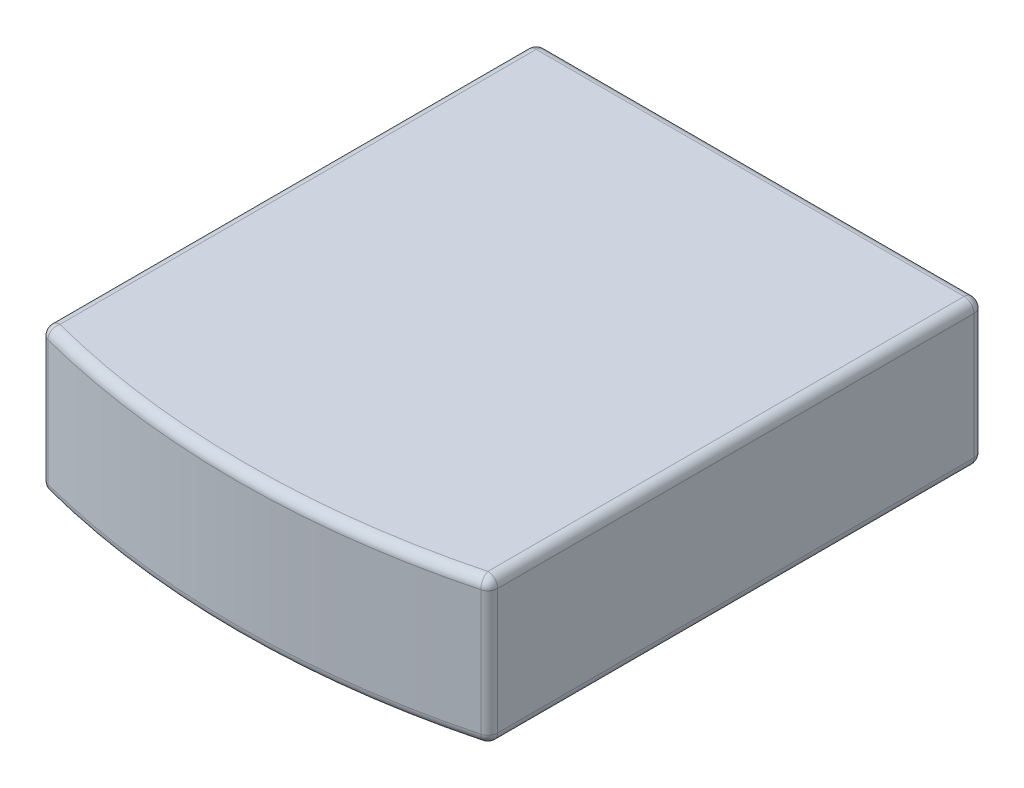
ISO-10303-21;
HEADER;
FILE_DESCRIPTION(('STEP AP214'),'2;1');
FILE_NAME('part.step','',(''),(''),'','','');
FILE_SCHEMA(('AUTOMOTIVE_DESIGN { 1 0 10303 214 1 1 1 1 }'));
ENDSEC;
DATA;
#1=APPLICATION_CONTEXT('core data for automotive mechanical design processes');
#2=APPLICATION_PROTOCOL_DEFINITION('international standard','automotive_design',2000,#1);
#3=PRODUCT_CONTEXT('',#1,'mechanical');
#4=PRODUCT('Part','Part','',(#3));
#5=PRODUCT_RELATED_PRODUCT_CATEGORY('part','',(#4));
#6=PRODUCT_DEFINITION_FORMATION('','',#4);
#7=PRODUCT_DEFINITION_CONTEXT('part definition',#1,'design');
#8=PRODUCT_DEFINITION('design','',#6,#7);
#9=PRODUCT_DEFINITION_SHAPE('','',#8);
#10=(LENGTH_UNIT() NAMED_UNIT(*) SI_UNIT(.MILLI.,.METRE.));
#11=(NAMED_UNIT(*) PLANE_ANGLE_UNIT() SI_UNIT($,.RADIAN.));
#12=(NAMED_UNIT(*) SI_UNIT($,.STERADIAN.) SOLID_ANGLE_UNIT());
#13=UNCERTAINTY_MEASURE_WITH_UNIT(LENGTH_MEASURE(1.E-05),#10,'distance_accuracy_value','');
#14=(GEOMETRIC_REPRESENTATION_CONTEXT(3) GLOBAL_UNCERTAINTY_ASSIGNED_CONTEXT((#13)) GLOBAL_UNIT_ASSIGNED_CONTEXT((#10,
#11,#12)) REPRESENTATION_CONTEXT('',''));
#15=CARTESIAN_POINT('',(0.,0.,0.));
#16=DIRECTION('',(0.,0.,1.));
#17=DIRECTION('',(1.,0.,0.));
#18=AXIS2_PLACEMENT_3D('',#15,#16,#17);
#19=CARTESIAN_POINT('',(-3.4,1.1,8.));
#20=DIRECTION('',(1.,0.,0.));
#21=DIRECTION('',(0.,1.,0.));
#22=AXIS2_PLACEMENT_3D('',#19,#20,#21);
#23=PLANE('',#22);
#24=DIRECTION('',(0.,0.,-1.));
#25=VECTOR('',#24,1.);
#26=CARTESIAN_POINT('',(-3.4,0.95,8.));
#27=LINE('',#26,#25);
#28=CARTESIAN_POINT('',(-3.4,0.95,7.38470650124955));
#29=VERTEX_POINT('',#28);
#30=CARTESIAN_POINT('',(-3.4,0.95,0.150000000000001));
#31=VERTEX_POINT('',#30);
#32=EDGE_CURVE('E164',#29,#31,#27,.T.);
#33=ORIENTED_EDGE('',*,*,#32,.T.);
#34=DIRECTION('',(0.,-1.,0.));
#35=VECTOR('',#34,1.);
#36=CARTESIAN_POINT('',(-3.4,1.1,0.150000000000001));
#37=LINE('',#36,#35);
#38=CARTESIAN_POINT('',(-3.4,-0.95,0.150000000000001));
#39=VERTEX_POINT('',#38);
#40=EDGE_CURVE('E169',#31,#39,#37,.T.);
#41=ORIENTED_EDGE('',*,*,#40,.T.);
#42=DIRECTION('',(0.,0.,-1.));
#43=VECTOR('',#42,1.);
#44=CARTESIAN_POINT('',(-3.4,-0.95,8.));
#45=LINE('',#44,#43);
#46=CARTESIAN_POINT('',(-3.4,-0.95,7.38470650124955));
#47=VERTEX_POINT('',#46);
#48=EDGE_CURVE('E166',#39,#47,#45,.F.);
#49=ORIENTED_EDGE('',*,*,#48,.T.);
#50=DIRECTION('',(0.,1.,0.));
#51=VECTOR('',#50,1.);
#52=CARTESIAN_POINT('',(-3.4,1.1,7.38470650124955));
#53=LINE('',#52,#51);
#54=EDGE_CURVE('E162',#47,#29,#53,.T.);
#55=ORIENTED_EDGE('',*,*,#54,.T.);
#56=EDGE_LOOP('',(#33,#41,#49,#55));
#57=FACE_BOUND('',#56,.T.);
#58=ADVANCED_FACE('F32',(#57),#23,.F.);
#59=CARTESIAN_POINT('',(-3.4,-1.1,8.));
#60=DIRECTION('',(0.,1.,0.));
#61=DIRECTION('',(-1.,0.,0.));
#62=AXIS2_PLACEMENT_3D('',#59,#60,#61);
#63=PLANE('',#62);
#64=DIRECTION('',(0.,0.,-1.));
#65=VECTOR('',#64,1.);
#66=CARTESIAN_POINT('',(-3.25,-1.1,8.));
#67=LINE('',#66,#65);
#68=CARTESIAN_POINT('',(-3.25,-1.1,7.38470650124954));
#69=VERTEX_POINT('',#68);
#70=CARTESIAN_POINT('',(-3.25,-1.1,0.150000000000001));
#71=VERTEX_POINT('',#70);
#72=EDGE_CURVE('E134',#69,#71,#67,.T.);
#73=ORIENTED_EDGE('',*,*,#72,.T.);
#74=DIRECTION('',(1.,0.,0.));
#75=VECTOR('',#74,1.);
#76=CARTESIAN_POINT('',(-3.4,-1.1,0.150000000000001));
#77=LINE('',#76,#75);
#78=CARTESIAN_POINT('',(3.25,-1.1,0.150000000000001));
#79=VERTEX_POINT('',#78);
#80=EDGE_CURVE('E130',#71,#79,#77,.T.);
#81=ORIENTED_EDGE('',*,*,#80,.T.);
#82=DIRECTION('',(0.,0.,-1.));
#83=VECTOR('',#82,1.);
#84=CARTESIAN_POINT('',(3.25,-1.1,8.));
#85=LINE('',#84,#83);
#86=CARTESIAN_POINT('',(3.25,-1.1,7.38470650124954));
#87=VERTEX_POINT('',#86);
#88=EDGE_CURVE('E123',#79,#87,#85,.F.);
#89=ORIENTED_EDGE('',*,*,#88,.T.);
#90=CARTESIAN_POINT('',(0.,-1.1,-5.04750971308649));
#91=DIRECTION('',(0.,1.,0.));
#92=DIRECTION('',(-1.,0.,0.));
#93=AXIS2_PLACEMENT_3D('',#90,#91,#92);
#94=CIRCLE('',#93,12.85);
#95=EDGE_CURVE('E127',#87,#69,#94,.F.);
#96=ORIENTED_EDGE('',*,*,#95,.T.);
#97=EDGE_LOOP('',(#73,#81,#89,#96));
#98=FACE_BOUND('',#97,.T.);
#99=ADVANCED_FACE('F126',(#98),#63,.F.);
#100=CARTESIAN_POINT('',(3.4,1.1,8.));
#101=DIRECTION('',(-1.,0.,0.));
#102=DIRECTION('',(0.,0.,1.));
#103=AXIS2_PLACEMENT_3D('',#100,#101,#102);
#104=PLANE('',#103);
#105=DIRECTION('',(0.,0.,-1.));
#106=VECTOR('',#105,1.);
#107=CARTESIAN_POINT('',(3.4,-0.950000000000001,8.));
#108=LINE('',#107,#106);
#109=CARTESIAN_POINT('',(3.4,-0.950000000000001,7.38470650124954));
#110=VERTEX_POINT('',#109);
#111=CARTESIAN_POINT('',(3.4,-0.950000000000001,0.150000000000001));
#112=VERTEX_POINT('',#111);
#113=EDGE_CURVE('E141',#110,#112,#108,.T.);
#114=ORIENTED_EDGE('',*,*,#113,.T.);
#115=DIRECTION('',(0.,1.,0.));
#116=VECTOR('',#115,1.);
#117=CARTESIAN_POINT('',(3.4,1.1,0.150000000000001));
#118=LINE('',#117,#116);
#119=CARTESIAN_POINT('',(3.4,0.95,0.150000000000001));
#120=VERTEX_POINT('',#119);
#121=EDGE_CURVE('E176',#112,#120,#118,.T.);
#122=ORIENTED_EDGE('',*,*,#121,.T.);
#123=DIRECTION('',(0.,0.,-1.));
#124=VECTOR('',#123,1.);
#125=CARTESIAN_POINT('',(3.4,0.95,8.));
#126=LINE('',#125,#124);
#127=CARTESIAN_POINT('',(3.4,0.95,7.38470650124954));
#128=VERTEX_POINT('',#127);
#129=EDGE_CURVE('E173',#120,#128,#126,.F.);
#130=ORIENTED_EDGE('',*,*,#129,.T.);
#131=DIRECTION('',(0.,1.,0.));
#132=VECTOR('',#131,1.);
#133=CARTESIAN_POINT('',(3.4,1.1,7.38470650124954));
#134=LINE('',#133,#132);
#135=EDGE_CURVE('E171',#128,#110,#134,.F.);
#136=ORIENTED_EDGE('',*,*,#135,.T.);
#137=EDGE_LOOP('',(#114,#122,#130,#136));
#138=FACE_BOUND('',#137,.T.);
#139=ADVANCED_FACE('F302',(#138),#104,.F.);
#140=CARTESIAN_POINT('',(-3.4,1.1,8.));
#141=DIRECTION('',(0.,-1.,0.));
#142=DIRECTION('',(1.,0.,0.));
#143=AXIS2_PLACEMENT_3D('',#140,#141,#142);
#144=PLANE('',#143);
#145=DIRECTION('',(0.,0.,-1.));
#146=VECTOR('',#145,1.);
#147=CARTESIAN_POINT('',(3.25,1.1,8.));
#148=LINE('',#147,#146);
#149=CARTESIAN_POINT('',(3.25,1.1,7.38470650124954));
#150=VERTEX_POINT('',#149);
#151=CARTESIAN_POINT('',(3.25,1.1,0.150000000000001));
#152=VERTEX_POINT('',#151);
#153=EDGE_CURVE('E182',#150,#152,#148,.T.);
#154=ORIENTED_EDGE('',*,*,#153,.T.);
#155=DIRECTION('',(-1.,0.,0.));
#156=VECTOR('',#155,1.);
#157=CARTESIAN_POINT('',(-3.4,1.1,0.150000000000001));
#158=LINE('',#157,#156);
#159=CARTESIAN_POINT('',(-3.25,1.1,0.150000000000001));
#160=VERTEX_POINT('',#159);
#161=EDGE_CURVE('E185',#152,#160,#158,.T.);
#162=ORIENTED_EDGE('',*,*,#161,.T.);
#163=DIRECTION('',(0.,0.,-1.));
#164=VECTOR('',#163,1.);
#165=CARTESIAN_POINT('',(-3.25,1.1,8.));
#166=LINE('',#165,#164);
#167=CARTESIAN_POINT('',(-3.25,1.1,7.38470650124954));
#168=VERTEX_POINT('',#167);
#169=EDGE_CURVE('E180',#160,#168,#166,.F.);
#170=ORIENTED_EDGE('',*,*,#169,.T.);
#171=CARTESIAN_POINT('',(0.,1.1,-5.04750971308649));
#172=DIRECTION('',(0.,-1.,0.));
#173=DIRECTION('',(1.,0.,0.));
#174=AXIS2_PLACEMENT_3D('',#171,#172,#173);
#175=CIRCLE('',#174,12.85);
#176=EDGE_CURVE('E178',#168,#150,#175,.F.);
#177=ORIENTED_EDGE('',*,*,#176,.T.);
#178=EDGE_LOOP('',(#154,#162,#170,#177));
#179=FACE_BOUND('',#178,.T.);
#180=ADVANCED_FACE('F289',(#179),#144,.F.);
#181=CARTESIAN_POINT('',(0.,0.,0.));
#182=DIRECTION('',(0.,0.,1.));
#183=DIRECTION('',(1.,0.,0.));
#184=AXIS2_PLACEMENT_3D('',#181,#182,#183);
#185=PLANE('',#184);
#186=DIRECTION('',(0.,-1.,0.));
#187=VECTOR('',#186,1.);
#188=CARTESIAN_POINT('',(-3.25,0.,0.));
#189=LINE('',#188,#187);
#190=CARTESIAN_POINT('',(-3.25,-0.95,0.));
#191=VERTEX_POINT('',#190);
#192=CARTESIAN_POINT('',(-3.25,0.95,0.));
#193=VERTEX_POINT('',#192);
#194=EDGE_CURVE('E187',#191,#193,#189,.F.);
#195=ORIENTED_EDGE('',*,*,#194,.T.);
#196=DIRECTION('',(-1.,0.,0.));
#197=VECTOR('',#196,1.);
#198=CARTESIAN_POINT('',(0.,0.95,0.));
#199=LINE('',#198,#197);
#200=CARTESIAN_POINT('',(3.25,0.95,0.));
#201=VERTEX_POINT('',#200);
#202=EDGE_CURVE('E193',#193,#201,#199,.F.);
#203=ORIENTED_EDGE('',*,*,#202,.T.);
#204=DIRECTION('',(0.,1.,0.));
#205=VECTOR('',#204,1.);
#206=CARTESIAN_POINT('',(3.25,0.,0.));
#207=LINE('',#206,#205);
#208=CARTESIAN_POINT('',(3.25,-0.95,0.));
#209=VERTEX_POINT('',#208);
#210=EDGE_CURVE('E191',#201,#209,#207,.F.);
#211=ORIENTED_EDGE('',*,*,#210,.T.);
#212=DIRECTION('',(1.,0.,0.));
#213=VECTOR('',#212,1.);
#214=CARTESIAN_POINT('',(0.,-0.95,0.));
#215=LINE('',#214,#213);
#216=EDGE_CURVE('E189',#209,#191,#215,.F.);
#217=ORIENTED_EDGE('',*,*,#216,.T.);
#218=EDGE_LOOP('',(#195,#203,#211,#217));
#219=FACE_BOUND('',#218,.T.);
#220=ADVANCED_FACE('F263',(#219),#185,.F.);
#221=CARTESIAN_POINT('',(0.,-6.9,-5.04750971308649));
#222=DIRECTION('',(0.,1.,0.));
#223=DIRECTION('',(-1.,0.,0.));
#224=AXIS2_PLACEMENT_3D('',#221,#222,#223);
#225=CYLINDRICAL_SURFACE('',#224,13.);
#226=DIRECTION('',(0.,1.,0.));
#227=VECTOR('',#226,1.);
#228=CARTESIAN_POINT('',(-3.28793774319066,-6.9,7.5298296477204));
#229=LINE('',#228,#227);
#230=CARTESIAN_POINT('',(-3.28793774319066,0.95,7.5298296477204));
#231=VERTEX_POINT('',#230);
#232=CARTESIAN_POINT('',(-3.28793774319066,-0.95,7.5298296477204));
#233=VERTEX_POINT('',#232);
#234=EDGE_CURVE('E56',#231,#233,#229,.F.);
#235=ORIENTED_EDGE('',*,*,#234,.T.);
#236=CARTESIAN_POINT('',(0.,-0.95,-5.04750971308649));
#237=DIRECTION('',(0.,1.,0.));
#238=DIRECTION('',(-1.,0.,0.));
#239=AXIS2_PLACEMENT_3D('',#236,#237,#238);
#240=CIRCLE('',#239,13.);
#241=CARTESIAN_POINT('',(3.28793774319066,-0.95,7.52982964772039));
#242=VERTEX_POINT('',#241);
#243=EDGE_CURVE('E11',#233,#242,#240,.T.);
#244=ORIENTED_EDGE('',*,*,#243,.T.);
#245=DIRECTION('',(0.,1.,0.));
#246=VECTOR('',#245,1.);
#247=CARTESIAN_POINT('',(3.28793774319066,-6.9,7.52982964772039));
#248=LINE('',#247,#246);
#249=CARTESIAN_POINT('',(3.28793774319066,0.949999999999999,7.52982964772039));
#250=VERTEX_POINT('',#249);
#251=EDGE_CURVE('E41',#242,#250,#248,.T.);
#252=ORIENTED_EDGE('',*,*,#251,.T.);
#253=CARTESIAN_POINT('',(0.,0.95,-5.04750971308649));
#254=DIRECTION('',(0.,-1.,0.));
#255=DIRECTION('',(1.,0.,0.));
#256=AXIS2_PLACEMENT_3D('',#253,#254,#255);
#257=CIRCLE('',#256,13.);
#258=EDGE_CURVE('E196',#250,#231,#257,.T.);
#259=ORIENTED_EDGE('',*,*,#258,.T.);
#260=EDGE_LOOP('',(#235,#244,#252,#259));
#261=FACE_BOUND('',#260,.T.);
#262=ADVANCED_FACE('F305',(#261),#225,.T.);
#263=CARTESIAN_POINT('',(3.25,0.95,8.));
#264=DIRECTION('',(0.,0.,-1.));
#265=DIRECTION('',(-1.,0.,0.));
#266=AXIS2_PLACEMENT_3D('',#263,#264,#265);
#267=CYLINDRICAL_SURFACE('',#266,0.15);
#268=CARTESIAN_POINT('',(3.25,0.95,7.38470650124954));
#269=DIRECTION('',(0.,0.,1.));
#270=DIRECTION('',(1.,0.,0.));
#271=AXIS2_PLACEMENT_3D('',#268,#269,#270);
#272=CIRCLE('',#271,0.15);
#273=EDGE_CURVE('E36',#128,#150,#272,.T.);
#274=ORIENTED_EDGE('',*,*,#273,.F.);
#275=ORIENTED_EDGE('',*,*,#129,.F.);
#276=CARTESIAN_POINT('',(3.25,0.95,0.150000000000001));
#277=DIRECTION('',(0.,0.,-1.));
#278=DIRECTION('',(-1.,0.,0.));
#279=AXIS2_PLACEMENT_3D('',#276,#277,#278);
#280=CIRCLE('',#279,0.15);
#281=EDGE_CURVE('E158',#152,#120,#280,.T.);
#282=ORIENTED_EDGE('',*,*,#281,.F.);
#283=ORIENTED_EDGE('',*,*,#153,.F.);
#284=EDGE_LOOP('',(#274,#275,#282,#283));
#285=FACE_BOUND('',#284,.T.);
#286=ADVANCED_FACE('F34',(#285),#267,.T.);
#287=CARTESIAN_POINT('',(3.25,0.95,7.38470650124955));
#288=DIRECTION('',(0.,0.,1.));
#289=DIRECTION('',(1.,0.,0.));
#290=AXIS2_PLACEMENT_3D('',#287,#288,#289);
#291=SPHERICAL_SURFACE('',#290,0.15);
#292=CARTESIAN_POINT('',(3.25,0.949999999999999,7.38470650124955));
#293=DIRECTION('',(0.,1.,0.));
#294=DIRECTION('',(-1.,0.,0.));
#295=AXIS2_PLACEMENT_3D('',#292,#293,#294);
#296=CIRCLE('',#295,0.15);
#297=EDGE_CURVE('E243',#128,#250,#296,.F.);
#298=ORIENTED_EDGE('',*,*,#297,.F.);
#299=ORIENTED_EDGE('',*,*,#273,.T.);
#300=CARTESIAN_POINT('',(3.25,0.95,7.38470650124954));
#301=DIRECTION('',(0.967487643138991,0.,-0.252918287937746));
#302=DIRECTION('',(-0.252918287937746,0.,-0.967487643138991));
#303=AXIS2_PLACEMENT_3D('',#300,#301,#302);
#304=CIRCLE('',#303,0.15);
#305=EDGE_CURVE('E246',#250,#150,#304,.F.);
#306=ORIENTED_EDGE('',*,*,#305,.F.);
#307=EDGE_LOOP('',(#298,#299,#306));
#308=FACE_BOUND('',#307,.T.);
#309=ADVANCED_FACE('F298',(#308),#291,.T.);
#310=CARTESIAN_POINT('',(3.25,0.95,0.15));
#311=DIRECTION('',(0.,0.,1.));
#312=DIRECTION('',(1.,0.,0.));
#313=AXIS2_PLACEMENT_3D('',#310,#311,#312);
#314=SPHERICAL_SURFACE('',#313,0.15);
#315=CARTESIAN_POINT('',(3.25,0.95,0.15));
#316=DIRECTION('',(1.,0.,0.));
#317=DIRECTION('',(0.,0.,-1.));
#318=AXIS2_PLACEMENT_3D('',#315,#316,#317);
#319=CIRCLE('',#318,0.15);
#320=EDGE_CURVE('E237',#152,#201,#319,.F.);
#321=ORIENTED_EDGE('',*,*,#320,.F.);
#322=ORIENTED_EDGE('',*,*,#281,.T.);
#323=CARTESIAN_POINT('',(3.25,0.95,0.150000000000001));
#324=DIRECTION('',(0.,1.,0.));
#325=DIRECTION('',(0.,0.,1.));
#326=AXIS2_PLACEMENT_3D('',#323,#324,#325);
#327=CIRCLE('',#326,0.15);
#328=EDGE_CURVE('E240',#201,#120,#327,.F.);
#329=ORIENTED_EDGE('',*,*,#328,.F.);
#330=EDGE_LOOP('',(#321,#322,#329));
#331=FACE_BOUND('',#330,.T.);
#332=ADVANCED_FACE('F253',(#331),#314,.T.);
#333=CARTESIAN_POINT('',(0.,0.95,-5.04750971308649));
#334=DIRECTION('',(0.,-1.,0.));
#335=DIRECTION('',(1.,0.,0.));
#336=AXIS2_PLACEMENT_3D('',#333,#334,#335);
#337=TOROIDAL_SURFACE('',#336,12.85,0.15);
#338=ORIENTED_EDGE('',*,*,#305,.T.);
#339=ORIENTED_EDGE('',*,*,#176,.F.);
#340=CARTESIAN_POINT('',(-3.25,0.95,7.38470650124955));
#341=DIRECTION('',(-0.967487643138992,0.,-0.252918287937742));
#342=DIRECTION('',(-0.252918287937742,0.,0.967487643138992));
#343=AXIS2_PLACEMENT_3D('',#340,#341,#342);
#344=CIRCLE('',#343,0.15);
#345=EDGE_CURVE('E231',#231,#168,#344,.T.);
#346=ORIENTED_EDGE('',*,*,#345,.F.);
#347=ORIENTED_EDGE('',*,*,#258,.F.);
#348=EDGE_LOOP('',(#338,#339,#346,#347));
#349=FACE_BOUND('',#348,.T.);
#350=ADVANCED_FACE('F292',(#349),#337,.T.);
#351=CARTESIAN_POINT('',(3.25,-6.9,7.38470650124954));
#352=DIRECTION('',(0.,1.,0.));
#353=DIRECTION('',(-1.,0.,0.));
#354=AXIS2_PLACEMENT_3D('',#351,#352,#353);
#355=CYLINDRICAL_SURFACE('',#354,0.15);
#356=ORIENTED_EDGE('',*,*,#297,.T.);
#357=ORIENTED_EDGE('',*,*,#251,.F.);
#358=CARTESIAN_POINT('',(3.25,-0.950000000000001,7.38470650124954));
#359=DIRECTION('',(0.,-1.,0.));
#360=DIRECTION('',(0.,0.,-1.));
#361=AXIS2_PLACEMENT_3D('',#358,#359,#360);
#362=CIRCLE('',#361,0.15);
#363=EDGE_CURVE('E144',#110,#242,#362,.T.);
#364=ORIENTED_EDGE('',*,*,#363,.F.);
#365=ORIENTED_EDGE('',*,*,#135,.F.);
#366=EDGE_LOOP('',(#356,#357,#364,#365));
#367=FACE_BOUND('',#366,.T.);
#368=ADVANCED_FACE('F304',(#367),#355,.T.);
#369=CARTESIAN_POINT('',(3.25,-0.950000000000001,8.));
#370=DIRECTION('',(0.,0.,-1.));
#371=DIRECTION('',(-1.,0.,0.));
#372=AXIS2_PLACEMENT_3D('',#369,#370,#371);
#373=CYLINDRICAL_SURFACE('',#372,0.15);
#374=CARTESIAN_POINT('',(3.25,-0.950000000000001,0.150000000000001));
#375=DIRECTION('',(0.,0.,-1.));
#376=DIRECTION('',(-1.,0.,0.));
#377=AXIS2_PLACEMENT_3D('',#374,#375,#376);
#378=CIRCLE('',#377,0.15);
#379=EDGE_CURVE('E145',#112,#79,#378,.T.);
#380=ORIENTED_EDGE('',*,*,#379,.F.);
#381=ORIENTED_EDGE('',*,*,#113,.F.);
#382=CARTESIAN_POINT('',(3.25,-0.95,7.38470650124954));
#383=DIRECTION('',(0.,0.,1.));
#384=DIRECTION('',(1.,0.,0.));
#385=AXIS2_PLACEMENT_3D('',#382,#383,#384);
#386=CIRCLE('',#385,0.15);
#387=EDGE_CURVE('E138',#87,#110,#386,.T.);
#388=ORIENTED_EDGE('',*,*,#387,.F.);
#389=ORIENTED_EDGE('',*,*,#88,.F.);
#390=EDGE_LOOP('',(#380,#381,#388,#389));
#391=FACE_BOUND('',#390,.T.);
#392=ADVANCED_FACE('F139',(#391),#373,.T.);
#393=CARTESIAN_POINT('',(3.25,1.1,0.150000000000001));
#394=DIRECTION('',(0.,1.,0.));
#395=DIRECTION('',(0.,0.,1.));
#396=AXIS2_PLACEMENT_3D('',#393,#394,#395);
#397=CYLINDRICAL_SURFACE('',#396,0.15);
#398=ORIENTED_EDGE('',*,*,#328,.T.);
#399=ORIENTED_EDGE('',*,*,#121,.F.);
#400=CARTESIAN_POINT('',(3.25,-0.95,0.15));
#401=DIRECTION('',(0.,-1.,0.));
#402=DIRECTION('',(1.,0.,0.));
#403=AXIS2_PLACEMENT_3D('',#400,#401,#402);
#404=CIRCLE('',#403,0.15);
#405=EDGE_CURVE('E227',#209,#112,#404,.T.);
#406=ORIENTED_EDGE('',*,*,#405,.F.);
#407=ORIENTED_EDGE('',*,*,#210,.F.);
#408=EDGE_LOOP('',(#398,#399,#406,#407));
#409=FACE_BOUND('',#408,.T.);
#410=ADVANCED_FACE('F259',(#409),#397,.T.);
#411=CARTESIAN_POINT('',(-3.4,0.95,0.150000000000001));
#412=DIRECTION('',(-1.,0.,0.));
#413=DIRECTION('',(0.,-1.,0.));
#414=AXIS2_PLACEMENT_3D('',#411,#412,#413);
#415=CYLINDRICAL_SURFACE('',#414,0.15);
#416=ORIENTED_EDGE('',*,*,#320,.T.);
#417=ORIENTED_EDGE('',*,*,#202,.F.);
#418=CARTESIAN_POINT('',(-3.25,0.95,0.150000000000001));
#419=DIRECTION('',(-1.,0.,0.));
#420=DIRECTION('',(0.,0.,1.));
#421=AXIS2_PLACEMENT_3D('',#418,#419,#420);
#422=CIRCLE('',#421,0.15);
#423=EDGE_CURVE('E224',#160,#193,#422,.T.);
#424=ORIENTED_EDGE('',*,*,#423,.F.);
#425=ORIENTED_EDGE('',*,*,#161,.F.);
#426=EDGE_LOOP('',(#416,#417,#424,#425));
#427=FACE_BOUND('',#426,.T.);
#428=ADVANCED_FACE('F269',(#427),#415,.T.);
#429=CARTESIAN_POINT('',(-3.25,0.95,8.));
#430=DIRECTION('',(0.,0.,-1.));
#431=DIRECTION('',(-1.,0.,0.));
#432=AXIS2_PLACEMENT_3D('',#429,#430,#431);
#433=CYLINDRICAL_SURFACE('',#432,0.15);
#434=CARTESIAN_POINT('',(-3.25,0.95,7.38470650124954));
#435=DIRECTION('',(0.,0.,1.));
#436=DIRECTION('',(1.,0.,0.));
#437=AXIS2_PLACEMENT_3D('',#434,#435,#436);
#438=CIRCLE('',#437,0.15);
#439=EDGE_CURVE('E234',#168,#29,#438,.T.);
#440=ORIENTED_EDGE('',*,*,#439,.F.);
#441=ORIENTED_EDGE('',*,*,#169,.F.);
#442=CARTESIAN_POINT('',(-3.25,0.95,0.150000000000001));
#443=DIRECTION('',(0.,0.,-1.));
#444=DIRECTION('',(-1.,0.,0.));
#445=AXIS2_PLACEMENT_3D('',#442,#443,#444);
#446=CIRCLE('',#445,0.15);
#447=EDGE_CURVE('E221',#31,#160,#446,.T.);
#448=ORIENTED_EDGE('',*,*,#447,.F.);
#449=ORIENTED_EDGE('',*,*,#32,.F.);
#450=EDGE_LOOP('',(#440,#441,#448,#449));
#451=FACE_BOUND('',#450,.T.);
#452=ADVANCED_FACE('F286',(#451),#433,.T.);
#453=CARTESIAN_POINT('',(-3.25,0.95,7.38470650124954));
#454=DIRECTION('',(0.,0.,1.));
#455=DIRECTION('',(1.,0.,0.));
#456=AXIS2_PLACEMENT_3D('',#453,#454,#455);
#457=SPHERICAL_SURFACE('',#456,0.15);
#458=ORIENTED_EDGE('',*,*,#345,.T.);
#459=ORIENTED_EDGE('',*,*,#439,.T.);
#460=CARTESIAN_POINT('',(-3.25,0.95,7.38470650124955));
#461=DIRECTION('',(0.,1.,0.));
#462=DIRECTION('',(0.,0.,1.));
#463=AXIS2_PLACEMENT_3D('',#460,#461,#462);
#464=CIRCLE('',#463,0.15);
#465=EDGE_CURVE('E149',#231,#29,#464,.F.);
#466=ORIENTED_EDGE('',*,*,#465,.F.);
#467=EDGE_LOOP('',(#458,#459,#466));
#468=FACE_BOUND('',#467,.T.);
#469=ADVANCED_FACE('F328',(#468),#457,.T.);
#470=CARTESIAN_POINT('',(3.25,-0.95,7.38470650124955));
#471=DIRECTION('',(0.,0.,1.));
#472=DIRECTION('',(1.,0.,0.));
#473=AXIS2_PLACEMENT_3D('',#470,#471,#472);
#474=SPHERICAL_SURFACE('',#473,0.15);
#475=ORIENTED_EDGE('',*,*,#387,.T.);
#476=ORIENTED_EDGE('',*,*,#363,.T.);
#477=CARTESIAN_POINT('',(3.25,-0.95,7.38470650124955));
#478=DIRECTION('',(0.967487643138992,0.,-0.252918287937742));
#479=DIRECTION('',(-0.252918287937742,0.,-0.967487643138992));
#480=AXIS2_PLACEMENT_3D('',#477,#478,#479);
#481=CIRCLE('',#480,0.15);
#482=EDGE_CURVE('E49',#87,#242,#481,.F.);
#483=ORIENTED_EDGE('',*,*,#482,.F.);
#484=EDGE_LOOP('',(#475,#476,#483));
#485=FACE_BOUND('',#484,.T.);
#486=ADVANCED_FACE('F147',(#485),#474,.T.);
#487=CARTESIAN_POINT('',(3.25,-0.95,0.15));
#488=DIRECTION('',(0.,0.,1.));
#489=DIRECTION('',(1.,0.,0.));
#490=AXIS2_PLACEMENT_3D('',#487,#488,#489);
#491=SPHERICAL_SURFACE('',#490,0.15);
#492=ORIENTED_EDGE('',*,*,#405,.T.);
#493=ORIENTED_EDGE('',*,*,#379,.T.);
#494=CARTESIAN_POINT('',(3.25,-0.95,0.150000000000001));
#495=DIRECTION('',(1.,0.,0.));
#496=DIRECTION('',(0.,0.,-1.));
#497=AXIS2_PLACEMENT_3D('',#494,#495,#496);
#498=CIRCLE('',#497,0.15);
#499=EDGE_CURVE('E150',#209,#79,#498,.F.);
#500=ORIENTED_EDGE('',*,*,#499,.F.);
#501=EDGE_LOOP('',(#492,#493,#500));
#502=FACE_BOUND('',#501,.T.);
#503=ADVANCED_FACE('F320',(#502),#491,.T.);
#504=CARTESIAN_POINT('',(-3.25,0.95,0.15));
#505=DIRECTION('',(0.,0.,1.));
#506=DIRECTION('',(1.,0.,0.));
#507=AXIS2_PLACEMENT_3D('',#504,#505,#506);
#508=SPHERICAL_SURFACE('',#507,0.15);
#509=ORIENTED_EDGE('',*,*,#447,.T.);
#510=ORIENTED_EDGE('',*,*,#423,.T.);
#511=CARTESIAN_POINT('',(-3.25,0.95,0.15));
#512=DIRECTION('',(0.,1.,0.));
#513=DIRECTION('',(-1.,0.,0.));
#514=AXIS2_PLACEMENT_3D('',#511,#512,#513);
#515=CIRCLE('',#514,0.15);
#516=EDGE_CURVE('E214',#31,#193,#515,.F.);
#517=ORIENTED_EDGE('',*,*,#516,.F.);
#518=EDGE_LOOP('',(#509,#510,#517));
#519=FACE_BOUND('',#518,.T.);
#520=ADVANCED_FACE('F272',(#519),#508,.T.);
#521=CARTESIAN_POINT('',(-3.25,-6.9,7.38470650124955));
#522=DIRECTION('',(0.,1.,0.));
#523=DIRECTION('',(-1.,0.,0.));
#524=AXIS2_PLACEMENT_3D('',#521,#522,#523);
#525=CYLINDRICAL_SURFACE('',#524,0.15);
#526=ORIENTED_EDGE('',*,*,#465,.T.);
#527=ORIENTED_EDGE('',*,*,#54,.F.);
#528=CARTESIAN_POINT('',(-3.25,-0.95,7.38470650124955));
#529=DIRECTION('',(0.,-1.,0.));
#530=DIRECTION('',(0.,0.,-1.));
#531=AXIS2_PLACEMENT_3D('',#528,#529,#530);
#532=CIRCLE('',#531,0.15);
#533=EDGE_CURVE('E211',#233,#47,#532,.T.);
#534=ORIENTED_EDGE('',*,*,#533,.F.);
#535=ORIENTED_EDGE('',*,*,#234,.F.);
#536=EDGE_LOOP('',(#526,#527,#534,#535));
#537=FACE_BOUND('',#536,.T.);
#538=ADVANCED_FACE('F308',(#537),#525,.T.);
#539=CARTESIAN_POINT('',(0.,-0.95,-5.04750971308649));
#540=DIRECTION('',(0.,1.,0.));
#541=DIRECTION('',(-1.,0.,0.));
#542=AXIS2_PLACEMENT_3D('',#539,#540,#541);
#543=TOROIDAL_SURFACE('',#542,12.85,0.15);
#544=ORIENTED_EDGE('',*,*,#482,.T.);
#545=ORIENTED_EDGE('',*,*,#243,.F.);
#546=CARTESIAN_POINT('',(-3.25,-0.95,7.38470650124954));
#547=DIRECTION('',(-0.967487643138995,0.,-0.252918287937729));
#548=DIRECTION('',(-0.252918287937729,0.,0.967487643138995));
#549=AXIS2_PLACEMENT_3D('',#546,#547,#548);
#550=CIRCLE('',#549,0.15);
#551=EDGE_CURVE('E154',#69,#233,#550,.T.);
#552=ORIENTED_EDGE('',*,*,#551,.F.);
#553=ORIENTED_EDGE('',*,*,#95,.F.);
#554=EDGE_LOOP('',(#544,#545,#552,#553));
#555=FACE_BOUND('',#554,.T.);
#556=ADVANCED_FACE('F152',(#555),#543,.T.);
#557=CARTESIAN_POINT('',(-3.4,-0.95,0.150000000000001));
#558=DIRECTION('',(1.,0.,0.));
#559=DIRECTION('',(0.,1.,0.));
#560=AXIS2_PLACEMENT_3D('',#557,#558,#559);
#561=CYLINDRICAL_SURFACE('',#560,0.15);
#562=ORIENTED_EDGE('',*,*,#499,.T.);
#563=ORIENTED_EDGE('',*,*,#80,.F.);
#564=CARTESIAN_POINT('',(-3.25,-0.95,0.15));
#565=DIRECTION('',(-1.,0.,0.));
#566=DIRECTION('',(0.,0.,1.));
#567=AXIS2_PLACEMENT_3D('',#564,#565,#566);
#568=CIRCLE('',#567,0.15);
#569=EDGE_CURVE('E207',#191,#71,#568,.T.);
#570=ORIENTED_EDGE('',*,*,#569,.F.);
#571=ORIENTED_EDGE('',*,*,#216,.F.);
#572=EDGE_LOOP('',(#562,#563,#570,#571));
#573=FACE_BOUND('',#572,.T.);
#574=ADVANCED_FACE('F318',(#573),#561,.T.);
#575=CARTESIAN_POINT('',(-3.25,1.1,0.150000000000001));
#576=DIRECTION('',(0.,-1.,0.));
#577=DIRECTION('',(1.,0.,0.));
#578=AXIS2_PLACEMENT_3D('',#575,#576,#577);
#579=CYLINDRICAL_SURFACE('',#578,0.15);
#580=ORIENTED_EDGE('',*,*,#516,.T.);
#581=ORIENTED_EDGE('',*,*,#194,.F.);
#582=CARTESIAN_POINT('',(-3.25,-0.95,0.150000000000001));
#583=DIRECTION('',(0.,-1.,0.));
#584=DIRECTION('',(1.,0.,0.));
#585=AXIS2_PLACEMENT_3D('',#582,#583,#584);
#586=CIRCLE('',#585,0.15);
#587=EDGE_CURVE('E204',#39,#191,#586,.T.);
#588=ORIENTED_EDGE('',*,*,#587,.F.);
#589=ORIENTED_EDGE('',*,*,#40,.F.);
#590=EDGE_LOOP('',(#580,#581,#588,#589));
#591=FACE_BOUND('',#590,.T.);
#592=ADVANCED_FACE('F276',(#591),#579,.T.);
#593=CARTESIAN_POINT('',(-3.25,-0.95,7.38470650124954));
#594=DIRECTION('',(0.,0.,1.));
#595=DIRECTION('',(1.,0.,0.));
#596=AXIS2_PLACEMENT_3D('',#593,#594,#595);
#597=SPHERICAL_SURFACE('',#596,0.15);
#598=ORIENTED_EDGE('',*,*,#551,.T.);
#599=ORIENTED_EDGE('',*,*,#533,.T.);
#600=CARTESIAN_POINT('',(-3.25,-0.95,7.38470650124955));
#601=DIRECTION('',(0.,0.,1.));
#602=DIRECTION('',(0.,-1.,0.));
#603=AXIS2_PLACEMENT_3D('',#600,#601,#602);
#604=CIRCLE('',#603,0.15);
#605=EDGE_CURVE('E202',#69,#47,#604,.F.);
#606=ORIENTED_EDGE('',*,*,#605,.F.);
#607=EDGE_LOOP('',(#598,#599,#606));
#608=FACE_BOUND('',#607,.T.);
#609=ADVANCED_FACE('F310',(#608),#597,.T.);
#610=CARTESIAN_POINT('',(-3.25,-0.95,0.15));
#611=DIRECTION('',(0.,0.,1.));
#612=DIRECTION('',(1.,0.,0.));
#613=AXIS2_PLACEMENT_3D('',#610,#611,#612);
#614=SPHERICAL_SURFACE('',#613,0.15);
#615=ORIENTED_EDGE('',*,*,#587,.T.);
#616=ORIENTED_EDGE('',*,*,#569,.T.);
#617=CARTESIAN_POINT('',(-3.25,-0.95,0.150000000000001));
#618=DIRECTION('',(0.,0.,-1.));
#619=DIRECTION('',(-1.,0.,0.));
#620=AXIS2_PLACEMENT_3D('',#617,#618,#619);
#621=CIRCLE('',#620,0.15);
#622=EDGE_CURVE('E200',#39,#71,#621,.F.);
#623=ORIENTED_EDGE('',*,*,#622,.F.);
#624=EDGE_LOOP('',(#615,#616,#623));
#625=FACE_BOUND('',#624,.T.);
#626=ADVANCED_FACE('F316',(#625),#614,.T.);
#627=CARTESIAN_POINT('',(-3.25,-0.95,8.));
#628=DIRECTION('',(0.,0.,-1.));
#629=DIRECTION('',(-1.,0.,0.));
#630=AXIS2_PLACEMENT_3D('',#627,#628,#629);
#631=CYLINDRICAL_SURFACE('',#630,0.15);
#632=ORIENTED_EDGE('',*,*,#605,.T.);
#633=ORIENTED_EDGE('',*,*,#48,.F.);
#634=ORIENTED_EDGE('',*,*,#622,.T.);
#635=ORIENTED_EDGE('',*,*,#72,.F.);
#636=EDGE_LOOP('',(#632,#633,#634,#635));
#637=FACE_BOUND('',#636,.T.);
#638=ADVANCED_FACE('F313',(#637),#631,.T.);
#639=CLOSED_SHELL('',(#58,#99,#139,#180,#220,#262,#286,#309,#332,#350,#368,#392,#410,#428,#452,
#469,#486,#503,#520,#538,#556,#574,#592,#609,#626,#638));
#640=MANIFOLD_SOLID_BREP('B2',#639);
#641=ADVANCED_BREP_SHAPE_REPRESENTATION('',(#18,#640),#14);
#642=SHAPE_DEFINITION_REPRESENTATION(#9,#641);
ENDSEC;
END-ISO-10303-21;
